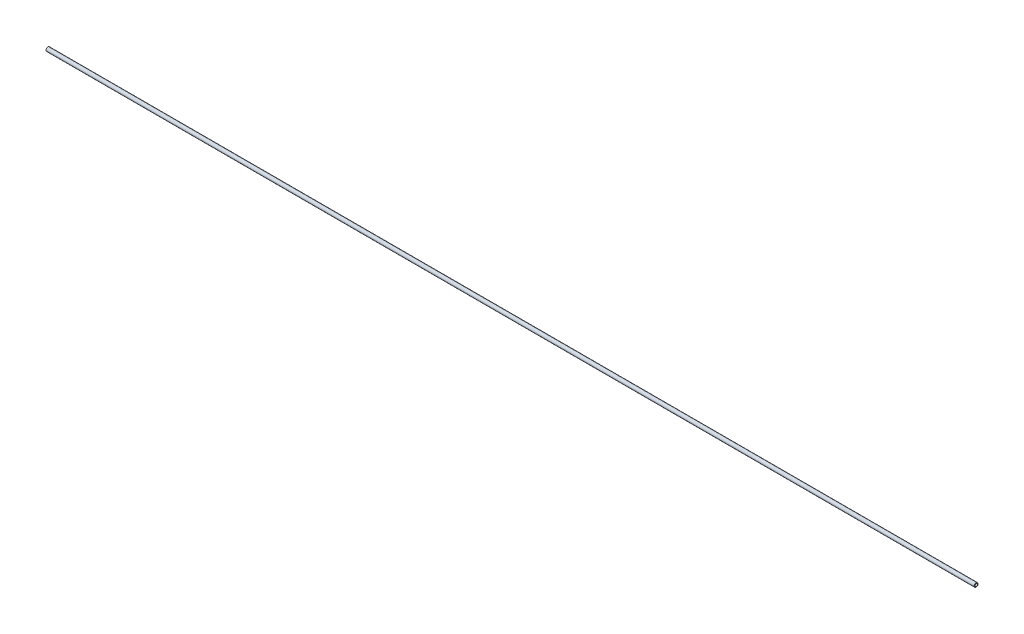
ISO-10303-21;
HEADER;
FILE_DESCRIPTION(('STEP AP214'),'2;1');
FILE_NAME('part.step','',(''),(''),'','','');
FILE_SCHEMA(('AUTOMOTIVE_DESIGN { 1 0 10303 214 1 1 1 1 }'));
ENDSEC;
DATA;
#1=APPLICATION_CONTEXT('core data for automotive mechanical design processes');
#2=APPLICATION_PROTOCOL_DEFINITION('international standard','automotive_design',2000,#1);
#3=PRODUCT_CONTEXT('',#1,'mechanical');
#4=PRODUCT('Part','Part','',(#3));
#5=PRODUCT_RELATED_PRODUCT_CATEGORY('part','',(#4));
#6=PRODUCT_DEFINITION_FORMATION('','',#4);
#7=PRODUCT_DEFINITION_CONTEXT('part definition',#1,'design');
#8=PRODUCT_DEFINITION('design','',#6,#7);
#9=PRODUCT_DEFINITION_SHAPE('','',#8);
#10=(LENGTH_UNIT() NAMED_UNIT(*) SI_UNIT(.MILLI.,.METRE.));
#11=(NAMED_UNIT(*) PLANE_ANGLE_UNIT() SI_UNIT($,.RADIAN.));
#12=(NAMED_UNIT(*) SI_UNIT($,.STERADIAN.) SOLID_ANGLE_UNIT());
#13=UNCERTAINTY_MEASURE_WITH_UNIT(LENGTH_MEASURE(1.E-05),#10,'distance_accuracy_value','');
#14=(GEOMETRIC_REPRESENTATION_CONTEXT(3) GLOBAL_UNCERTAINTY_ASSIGNED_CONTEXT((#13)) GLOBAL_UNIT_ASSIGNED_CONTEXT((#10,
#11,#12)) REPRESENTATION_CONTEXT('',''));
#15=CARTESIAN_POINT('',(0.,0.,0.));
#16=DIRECTION('',(0.,0.,1.));
#17=DIRECTION('',(1.,0.,0.));
#18=AXIS2_PLACEMENT_3D('',#15,#16,#17);
#19=CARTESIAN_POINT('',(-1524.,0.,0.));
#20=DIRECTION('',(-1.,0.,0.));
#21=DIRECTION('',(0.,0.,1.));
#22=AXIS2_PLACEMENT_3D('',#19,#20,#21);
#23=PLANE('',#22);
#24=CARTESIAN_POINT('',(-1524.,0.,0.));
#25=DIRECTION('',(-1.,0.,0.));
#26=DIRECTION('',(0.,0.,1.));
#27=AXIS2_PLACEMENT_3D('',#24,#25,#26);
#28=CIRCLE('',#27,2.79400000000041);
#29=CARTESIAN_POINT('',(-1524.,0.,2.79400000000041));
#30=VERTEX_POINT('',#29);
#31=EDGE_CURVE('E10',#30,#30,#28,.T.);
#32=ORIENTED_EDGE('',*,*,#31,.T.);
#33=EDGE_LOOP('',(#32));
#34=FACE_BOUND('',#33,.T.);
#35=CARTESIAN_POINT('',(-1524.,0.,0.));
#36=DIRECTION('',(-1.,0.,0.));
#37=DIRECTION('',(0.,0.,1.));
#38=AXIS2_PLACEMENT_3D('',#35,#36,#37);
#39=CIRCLE('',#38,1.9304);
#40=CARTESIAN_POINT('',(-1524.,0.,1.9304));
#41=VERTEX_POINT('',#40);
#42=EDGE_CURVE('E51',#41,#41,#39,.T.);
#43=ORIENTED_EDGE('',*,*,#42,.F.);
#44=EDGE_LOOP('',(#43));
#45=FACE_BOUND('',#44,.T.);
#46=ADVANCED_FACE('F31',(#34,#45),#23,.T.);
#47=CARTESIAN_POINT('',(0.,0.,0.));
#48=DIRECTION('',(-1.,0.,0.));
#49=DIRECTION('',(0.,0.,1.));
#50=AXIS2_PLACEMENT_3D('',#47,#48,#49);
#51=PLANE('',#50);
#52=CARTESIAN_POINT('',(0.,0.,0.));
#53=DIRECTION('',(-1.,0.,0.));
#54=DIRECTION('',(0.,0.,1.));
#55=AXIS2_PLACEMENT_3D('',#52,#53,#54);
#56=CIRCLE('',#55,2.79399999999996);
#57=CARTESIAN_POINT('',(0.,0.,2.79399999999996));
#58=VERTEX_POINT('',#57);
#59=EDGE_CURVE('E38',#58,#58,#56,.F.);
#60=ORIENTED_EDGE('',*,*,#59,.T.);
#61=EDGE_LOOP('',(#60));
#62=FACE_BOUND('',#61,.T.);
#63=CARTESIAN_POINT('',(0.,0.,0.));
#64=DIRECTION('',(-1.,0.,0.));
#65=DIRECTION('',(0.,0.,1.));
#66=AXIS2_PLACEMENT_3D('',#63,#64,#65);
#67=CIRCLE('',#66,1.9304);
#68=CARTESIAN_POINT('',(0.,0.,1.9304));
#69=VERTEX_POINT('',#68);
#70=EDGE_CURVE('E52',#69,#69,#67,.T.);
#71=ORIENTED_EDGE('',*,*,#70,.T.);
#72=EDGE_LOOP('',(#71));
#73=FACE_BOUND('',#72,.T.);
#74=ADVANCED_FACE('F62',(#62,#73),#51,.F.);
#75=CARTESIAN_POINT('',(-1524.,0.,0.));
#76=DIRECTION('',(1.,0.,0.));
#77=DIRECTION('',(0.,0.,-1.));
#78=AXIS2_PLACEMENT_3D('',#75,#76,#77);
#79=CYLINDRICAL_SURFACE('',#78,3.175);
#80=CARTESIAN_POINT('',(-0.380999999999743,0.,0.));
#81=DIRECTION('',(-1.,0.,0.));
#82=DIRECTION('',(0.,0.,1.));
#83=AXIS2_PLACEMENT_3D('',#80,#81,#82);
#84=CIRCLE('',#83,3.175);
#85=CARTESIAN_POINT('',(-0.380999999999743,0.,3.175));
#86=VERTEX_POINT('',#85);
#87=EDGE_CURVE('E42',#86,#86,#84,.T.);
#88=ORIENTED_EDGE('',*,*,#87,.T.);
#89=EDGE_LOOP('',(#88));
#90=FACE_BOUND('',#89,.T.);
#91=CARTESIAN_POINT('',(-1523.619,0.,0.));
#92=DIRECTION('',(-1.,0.,0.));
#93=DIRECTION('',(0.,0.,1.));
#94=AXIS2_PLACEMENT_3D('',#91,#92,#93);
#95=CIRCLE('',#94,3.175);
#96=CARTESIAN_POINT('',(-1523.619,0.,3.175));
#97=VERTEX_POINT('',#96);
#98=EDGE_CURVE('E46',#97,#97,#95,.F.);
#99=ORIENTED_EDGE('',*,*,#98,.T.);
#100=EDGE_LOOP('',(#99));
#101=FACE_BOUND('',#100,.T.);
#102=ADVANCED_FACE('F67',(#90,#101),#79,.T.);
#103=CARTESIAN_POINT('',(-1524.,0.,0.));
#104=DIRECTION('',(1.,0.,0.));
#105=DIRECTION('',(0.,0.,-1.));
#106=AXIS2_PLACEMENT_3D('',#103,#104,#105);
#107=CYLINDRICAL_SURFACE('',#106,1.9304);
#108=ORIENTED_EDGE('',*,*,#42,.T.);
#109=EDGE_LOOP('',(#108));
#110=FACE_BOUND('',#109,.T.);
#111=ORIENTED_EDGE('',*,*,#70,.F.);
#112=EDGE_LOOP('',(#111));
#113=FACE_BOUND('',#112,.T.);
#114=ADVANCED_FACE('F58',(#110,#113),#107,.F.);
#115=CARTESIAN_POINT('',(-0.380999999999743,0.,0.));
#116=DIRECTION('',(-1.,0.,0.));
#117=DIRECTION('',(0.,0.,1.));
#118=AXIS2_PLACEMENT_3D('',#115,#116,#117);
#119=CONICAL_SURFACE('',#118,3.175,0.785398163397834);
#120=ORIENTED_EDGE('',*,*,#59,.F.);
#121=EDGE_LOOP('',(#120));
#122=FACE_BOUND('',#121,.T.);
#123=ORIENTED_EDGE('',*,*,#87,.F.);
#124=EDGE_LOOP('',(#123));
#125=FACE_BOUND('',#124,.T.);
#126=ADVANCED_FACE('F73',(#122,#125),#119,.T.);
#127=CARTESIAN_POINT('',(-1524.,0.,0.));
#128=DIRECTION('',(1.,0.,0.));
#129=DIRECTION('',(0.,0.,-1.));
#130=AXIS2_PLACEMENT_3D('',#127,#128,#129);
#131=CONICAL_SURFACE('',#130,2.79400000000041,0.785398163397251);
#132=ORIENTED_EDGE('',*,*,#98,.F.);
#133=EDGE_LOOP('',(#132));
#134=FACE_BOUND('',#133,.T.);
#135=ORIENTED_EDGE('',*,*,#31,.F.);
#136=EDGE_LOOP('',(#135));
#137=FACE_BOUND('',#136,.T.);
#138=ADVANCED_FACE('F33',(#134,#137),#131,.T.);
#139=CLOSED_SHELL('',(#46,#74,#102,#114,#126,#138));
#140=MANIFOLD_SOLID_BREP('B2',#139);
#141=ADVANCED_BREP_SHAPE_REPRESENTATION('',(#18,#140),#14);
#142=SHAPE_DEFINITION_REPRESENTATION(#9,#141);
ENDSEC;
END-ISO-10303-21;
